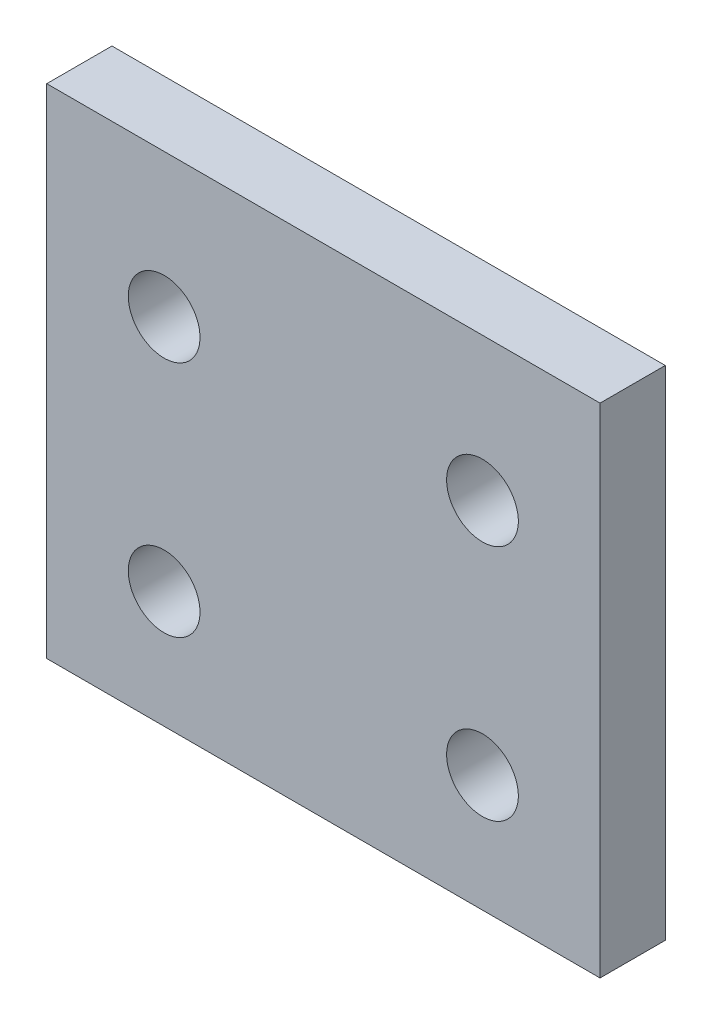
ISO-10303-21;
HEADER;
FILE_DESCRIPTION(('STEP AP214'),'2;1');
FILE_NAME('part.step','',(''),(''),'','','');
FILE_SCHEMA(('AUTOMOTIVE_DESIGN { 1 0 10303 214 1 1 1 1 }'));
ENDSEC;
DATA;
#1=APPLICATION_CONTEXT('core data for automotive mechanical design processes');
#2=APPLICATION_PROTOCOL_DEFINITION('international standard','automotive_design',2000,#1);
#3=PRODUCT_CONTEXT('',#1,'mechanical');
#4=PRODUCT('Part','Part','',(#3));
#5=PRODUCT_RELATED_PRODUCT_CATEGORY('part','',(#4));
#6=PRODUCT_DEFINITION_FORMATION('','',#4);
#7=PRODUCT_DEFINITION_CONTEXT('part definition',#1,'design');
#8=PRODUCT_DEFINITION('design','',#6,#7);
#9=PRODUCT_DEFINITION_SHAPE('','',#8);
#10=(LENGTH_UNIT() NAMED_UNIT(*) SI_UNIT(.MILLI.,.METRE.));
#11=(NAMED_UNIT(*) PLANE_ANGLE_UNIT() SI_UNIT($,.RADIAN.));
#12=(NAMED_UNIT(*) SI_UNIT($,.STERADIAN.) SOLID_ANGLE_UNIT());
#13=UNCERTAINTY_MEASURE_WITH_UNIT(LENGTH_MEASURE(1.E-05),#10,'distance_accuracy_value','');
#14=(GEOMETRIC_REPRESENTATION_CONTEXT(3) GLOBAL_UNCERTAINTY_ASSIGNED_CONTEXT((#13)) GLOBAL_UNIT_ASSIGNED_CONTEXT((#10,
#11,#12)) REPRESENTATION_CONTEXT('',''));
#15=CARTESIAN_POINT('',(0.,0.,0.));
#16=DIRECTION('',(0.,0.,1.));
#17=DIRECTION('',(1.,0.,0.));
#18=AXIS2_PLACEMENT_3D('',#15,#16,#17);
#19=CARTESIAN_POINT('',(0.,0.,2.5));
#20=DIRECTION('',(1.,0.,0.));
#21=DIRECTION('',(0.,0.,-1.));
#22=AXIS2_PLACEMENT_3D('',#19,#20,#21);
#23=PLANE('',#22);
#24=DIRECTION('',(0.,-1.,0.));
#25=VECTOR('',#24,1.);
#26=CARTESIAN_POINT('',(0.,0.,0.));
#27=LINE('',#26,#25);
#28=CARTESIAN_POINT('',(0.,19.08604853,0.));
#29=VERTEX_POINT('',#28);
#30=CARTESIAN_POINT('',(0.,0.,0.));
#31=VERTEX_POINT('',#30);
#32=EDGE_CURVE('E111',#29,#31,#27,.T.);
#33=ORIENTED_EDGE('',*,*,#32,.T.);
#34=DIRECTION('',(0.,0.,-1.));
#35=VECTOR('',#34,1.);
#36=CARTESIAN_POINT('',(0.,0.,2.5));
#37=LINE('',#36,#35);
#38=CARTESIAN_POINT('',(0.,0.,2.5));
#39=VERTEX_POINT('',#38);
#40=EDGE_CURVE('E11',#39,#31,#37,.T.);
#41=ORIENTED_EDGE('',*,*,#40,.F.);
#42=DIRECTION('',(0.,-1.,0.));
#43=VECTOR('',#42,1.);
#44=CARTESIAN_POINT('',(0.,0.,2.5));
#45=LINE('',#44,#43);
#46=CARTESIAN_POINT('',(0.,19.08604853,2.5));
#47=VERTEX_POINT('',#46);
#48=EDGE_CURVE('E94',#47,#39,#45,.T.);
#49=ORIENTED_EDGE('',*,*,#48,.F.);
#50=DIRECTION('',(0.,0.,-1.));
#51=VECTOR('',#50,1.);
#52=CARTESIAN_POINT('',(0.,19.08604853,2.5));
#53=LINE('',#52,#51);
#54=EDGE_CURVE('E107',#47,#29,#53,.T.);
#55=ORIENTED_EDGE('',*,*,#54,.T.);
#56=EDGE_LOOP('',(#33,#41,#49,#55));
#57=FACE_BOUND('',#56,.T.);
#58=ADVANCED_FACE('F42',(#57),#23,.F.);
#59=CARTESIAN_POINT('',(0.,0.,2.5));
#60=DIRECTION('',(0.,1.,0.));
#61=DIRECTION('',(0.,0.,1.));
#62=AXIS2_PLACEMENT_3D('',#59,#60,#61);
#63=PLANE('',#62);
#64=DIRECTION('',(1.,0.,0.));
#65=VECTOR('',#64,1.);
#66=CARTESIAN_POINT('',(0.,0.,0.));
#67=LINE('',#66,#65);
#68=CARTESIAN_POINT('',(21.21128765,0.,0.));
#69=VERTEX_POINT('',#68);
#70=EDGE_CURVE('E99',#31,#69,#67,.T.);
#71=ORIENTED_EDGE('',*,*,#70,.T.);
#72=DIRECTION('',(0.,0.,-1.));
#73=VECTOR('',#72,1.);
#74=CARTESIAN_POINT('',(21.21128765,0.,2.5));
#75=LINE('',#74,#73);
#76=CARTESIAN_POINT('',(21.21128765,0.,2.5));
#77=VERTEX_POINT('',#76);
#78=EDGE_CURVE('E51',#77,#69,#75,.T.);
#79=ORIENTED_EDGE('',*,*,#78,.F.);
#80=DIRECTION('',(1.,0.,0.));
#81=VECTOR('',#80,1.);
#82=CARTESIAN_POINT('',(0.,0.,2.5));
#83=LINE('',#82,#81);
#84=EDGE_CURVE('E89',#39,#77,#83,.T.);
#85=ORIENTED_EDGE('',*,*,#84,.F.);
#86=ORIENTED_EDGE('',*,*,#40,.T.);
#87=EDGE_LOOP('',(#71,#79,#85,#86));
#88=FACE_BOUND('',#87,.T.);
#89=ADVANCED_FACE('F98',(#88),#63,.F.);
#90=CARTESIAN_POINT('',(21.21128765,0.,2.5));
#91=DIRECTION('',(-1.,0.,0.));
#92=DIRECTION('',(0.,0.,1.));
#93=AXIS2_PLACEMENT_3D('',#90,#91,#92);
#94=PLANE('',#93);
#95=DIRECTION('',(0.,1.,0.));
#96=VECTOR('',#95,1.);
#97=CARTESIAN_POINT('',(21.21128765,0.,0.));
#98=LINE('',#97,#96);
#99=CARTESIAN_POINT('',(21.21128765,19.08604853,0.));
#100=VERTEX_POINT('',#99);
#101=EDGE_CURVE('E76',#69,#100,#98,.T.);
#102=ORIENTED_EDGE('',*,*,#101,.T.);
#103=DIRECTION('',(0.,0.,-1.));
#104=VECTOR('',#103,1.);
#105=CARTESIAN_POINT('',(21.21128765,19.08604853,2.5));
#106=LINE('',#105,#104);
#107=CARTESIAN_POINT('',(21.21128765,19.08604853,2.5));
#108=VERTEX_POINT('',#107);
#109=EDGE_CURVE('E101',#108,#100,#106,.T.);
#110=ORIENTED_EDGE('',*,*,#109,.F.);
#111=DIRECTION('',(0.,1.,0.));
#112=VECTOR('',#111,1.);
#113=CARTESIAN_POINT('',(21.21128765,0.,2.5));
#114=LINE('',#113,#112);
#115=EDGE_CURVE('E92',#77,#108,#114,.T.);
#116=ORIENTED_EDGE('',*,*,#115,.F.);
#117=ORIENTED_EDGE('',*,*,#78,.T.);
#118=EDGE_LOOP('',(#102,#110,#116,#117));
#119=FACE_BOUND('',#118,.T.);
#120=ADVANCED_FACE('F102',(#119),#94,.F.);
#121=CARTESIAN_POINT('',(0.,19.08604853,2.5));
#122=DIRECTION('',(0.,-1.,0.));
#123=DIRECTION('',(0.,0.,-1.));
#124=AXIS2_PLACEMENT_3D('',#121,#122,#123);
#125=PLANE('',#124);
#126=DIRECTION('',(-1.,0.,0.));
#127=VECTOR('',#126,1.);
#128=CARTESIAN_POINT('',(0.,19.08604853,0.));
#129=LINE('',#128,#127);
#130=EDGE_CURVE('E82',#100,#29,#129,.T.);
#131=ORIENTED_EDGE('',*,*,#130,.T.);
#132=ORIENTED_EDGE('',*,*,#54,.F.);
#133=DIRECTION('',(-1.,0.,0.));
#134=VECTOR('',#133,1.);
#135=CARTESIAN_POINT('',(0.,19.08604853,2.5));
#136=LINE('',#135,#134);
#137=EDGE_CURVE('E59',#108,#47,#136,.T.);
#138=ORIENTED_EDGE('',*,*,#137,.F.);
#139=ORIENTED_EDGE('',*,*,#109,.T.);
#140=EDGE_LOOP('',(#131,#132,#138,#139));
#141=FACE_BOUND('',#140,.T.);
#142=ADVANCED_FACE('F126',(#141),#125,.F.);
#143=CARTESIAN_POINT('',(0.,0.,2.5));
#144=DIRECTION('',(0.,0.,-1.));
#145=DIRECTION('',(-1.,0.,0.));
#146=AXIS2_PLACEMENT_3D('',#143,#144,#145);
#147=PLANE('',#146);
#148=CARTESIAN_POINT('',(4.50061561,13.5977062,2.5));
#149=DIRECTION('',(0.,0.,-1.));
#150=DIRECTION('',(-1.,0.,0.));
#151=AXIS2_PLACEMENT_3D('',#148,#149,#150);
#152=CIRCLE('',#151,1.375);
#153=CARTESIAN_POINT('',(3.12561561,13.5977062,2.5));
#154=VERTEX_POINT('',#153);
#155=EDGE_CURVE('E138',#154,#154,#152,.T.);
#156=ORIENTED_EDGE('',*,*,#155,.T.);
#157=EDGE_LOOP('',(#156));
#158=FACE_BOUND('',#157,.T.);
#159=CARTESIAN_POINT('',(16.70317329,4.48009656,2.5));
#160=DIRECTION('',(0.,0.,-1.));
#161=DIRECTION('',(-1.,0.,0.));
#162=AXIS2_PLACEMENT_3D('',#159,#160,#161);
#163=CIRCLE('',#162,1.375);
#164=CARTESIAN_POINT('',(15.32817329,4.48009656,2.5));
#165=VERTEX_POINT('',#164);
#166=EDGE_CURVE('E146',#165,#165,#163,.T.);
#167=ORIENTED_EDGE('',*,*,#166,.T.);
#168=EDGE_LOOP('',(#167));
#169=FACE_BOUND('',#168,.T.);
#170=CARTESIAN_POINT('',(4.50061561,4.48009656,2.5));
#171=DIRECTION('',(0.,0.,-1.));
#172=DIRECTION('',(-1.,0.,0.));
#173=AXIS2_PLACEMENT_3D('',#170,#171,#172);
#174=CIRCLE('',#173,1.375);
#175=CARTESIAN_POINT('',(3.12561561,4.48009656,2.5));
#176=VERTEX_POINT('',#175);
#177=EDGE_CURVE('E147',#176,#176,#174,.T.);
#178=ORIENTED_EDGE('',*,*,#177,.T.);
#179=EDGE_LOOP('',(#178));
#180=FACE_BOUND('',#179,.T.);
#181=CARTESIAN_POINT('',(16.70317329,13.5977062,2.5));
#182=DIRECTION('',(0.,0.,-1.));
#183=DIRECTION('',(-1.,0.,0.));
#184=AXIS2_PLACEMENT_3D('',#181,#182,#183);
#185=CIRCLE('',#184,1.375);
#186=CARTESIAN_POINT('',(15.32817329,13.5977062,2.5));
#187=VERTEX_POINT('',#186);
#188=EDGE_CURVE('E115',#187,#187,#185,.T.);
#189=ORIENTED_EDGE('',*,*,#188,.T.);
#190=EDGE_LOOP('',(#189));
#191=FACE_BOUND('',#190,.T.);
#192=ORIENTED_EDGE('',*,*,#48,.T.);
#193=ORIENTED_EDGE('',*,*,#84,.T.);
#194=ORIENTED_EDGE('',*,*,#115,.T.);
#195=ORIENTED_EDGE('',*,*,#137,.T.);
#196=EDGE_LOOP('',(#192,#193,#194,#195));
#197=FACE_BOUND('',#196,.T.);
#198=ADVANCED_FACE('F90',(#158,#169,#180,#191,#197),#147,.F.);
#199=CARTESIAN_POINT('',(0.,0.,0.));
#200=DIRECTION('',(0.,0.,-1.));
#201=DIRECTION('',(-1.,0.,0.));
#202=AXIS2_PLACEMENT_3D('',#199,#200,#201);
#203=PLANE('',#202);
#204=CARTESIAN_POINT('',(4.50061561,13.5977062,0.));
#205=DIRECTION('',(0.,0.,-1.));
#206=DIRECTION('',(-1.,0.,0.));
#207=AXIS2_PLACEMENT_3D('',#204,#205,#206);
#208=CIRCLE('',#207,1.375);
#209=CARTESIAN_POINT('',(3.12561561,13.5977062,0.));
#210=VERTEX_POINT('',#209);
#211=EDGE_CURVE('E151',#210,#210,#208,.T.);
#212=ORIENTED_EDGE('',*,*,#211,.F.);
#213=EDGE_LOOP('',(#212));
#214=FACE_BOUND('',#213,.T.);
#215=CARTESIAN_POINT('',(16.70317329,4.48009656,0.));
#216=DIRECTION('',(0.,0.,-1.));
#217=DIRECTION('',(-1.,0.,0.));
#218=AXIS2_PLACEMENT_3D('',#215,#216,#217);
#219=CIRCLE('',#218,1.375);
#220=CARTESIAN_POINT('',(15.32817329,4.48009656,0.));
#221=VERTEX_POINT('',#220);
#222=EDGE_CURVE('E142',#221,#221,#219,.T.);
#223=ORIENTED_EDGE('',*,*,#222,.F.);
#224=EDGE_LOOP('',(#223));
#225=FACE_BOUND('',#224,.T.);
#226=CARTESIAN_POINT('',(4.50061561,4.48009656,0.));
#227=DIRECTION('',(0.,0.,-1.));
#228=DIRECTION('',(-1.,0.,0.));
#229=AXIS2_PLACEMENT_3D('',#226,#227,#228);
#230=CIRCLE('',#229,1.375);
#231=CARTESIAN_POINT('',(3.12561561,4.48009656,0.));
#232=VERTEX_POINT('',#231);
#233=EDGE_CURVE('E158',#232,#232,#230,.T.);
#234=ORIENTED_EDGE('',*,*,#233,.F.);
#235=EDGE_LOOP('',(#234));
#236=FACE_BOUND('',#235,.T.);
#237=CARTESIAN_POINT('',(16.70317329,13.5977062,0.));
#238=DIRECTION('',(0.,0.,-1.));
#239=DIRECTION('',(-1.,0.,0.));
#240=AXIS2_PLACEMENT_3D('',#237,#238,#239);
#241=CIRCLE('',#240,1.375);
#242=CARTESIAN_POINT('',(15.32817329,13.5977062,0.));
#243=VERTEX_POINT('',#242);
#244=EDGE_CURVE('E134',#243,#243,#241,.T.);
#245=ORIENTED_EDGE('',*,*,#244,.F.);
#246=EDGE_LOOP('',(#245));
#247=FACE_BOUND('',#246,.T.);
#248=ORIENTED_EDGE('',*,*,#32,.F.);
#249=ORIENTED_EDGE('',*,*,#130,.F.);
#250=ORIENTED_EDGE('',*,*,#101,.F.);
#251=ORIENTED_EDGE('',*,*,#70,.F.);
#252=EDGE_LOOP('',(#248,#249,#250,#251));
#253=FACE_BOUND('',#252,.T.);
#254=ADVANCED_FACE('F129',(#214,#225,#236,#247,#253),#203,.T.);
#255=CARTESIAN_POINT('',(16.70317329,13.5977062,2.5));
#256=DIRECTION('',(0.,0.,-1.));
#257=DIRECTION('',(-1.,0.,0.));
#258=AXIS2_PLACEMENT_3D('',#255,#256,#257);
#259=CYLINDRICAL_SURFACE('',#258,1.375);
#260=ORIENTED_EDGE('',*,*,#188,.F.);
#261=EDGE_LOOP('',(#260));
#262=FACE_BOUND('',#261,.T.);
#263=ORIENTED_EDGE('',*,*,#244,.T.);
#264=EDGE_LOOP('',(#263));
#265=FACE_BOUND('',#264,.T.);
#266=ADVANCED_FACE('F173',(#262,#265),#259,.F.);
#267=CARTESIAN_POINT('',(4.50061561,4.48009656,2.5));
#268=DIRECTION('',(0.,0.,-1.));
#269=DIRECTION('',(-1.,0.,0.));
#270=AXIS2_PLACEMENT_3D('',#267,#268,#269);
#271=CYLINDRICAL_SURFACE('',#270,1.375);
#272=ORIENTED_EDGE('',*,*,#177,.F.);
#273=EDGE_LOOP('',(#272));
#274=FACE_BOUND('',#273,.T.);
#275=ORIENTED_EDGE('',*,*,#233,.T.);
#276=EDGE_LOOP('',(#275));
#277=FACE_BOUND('',#276,.T.);
#278=ADVANCED_FACE('F169',(#274,#277),#271,.F.);
#279=CARTESIAN_POINT('',(16.70317329,4.48009656,2.5));
#280=DIRECTION('',(0.,0.,-1.));
#281=DIRECTION('',(-1.,0.,0.));
#282=AXIS2_PLACEMENT_3D('',#279,#280,#281);
#283=CYLINDRICAL_SURFACE('',#282,1.375);
#284=ORIENTED_EDGE('',*,*,#166,.F.);
#285=EDGE_LOOP('',(#284));
#286=FACE_BOUND('',#285,.T.);
#287=ORIENTED_EDGE('',*,*,#222,.T.);
#288=EDGE_LOOP('',(#287));
#289=FACE_BOUND('',#288,.T.);
#290=ADVANCED_FACE('F172',(#286,#289),#283,.F.);
#291=CARTESIAN_POINT('',(4.50061561,13.5977062,2.5));
#292=DIRECTION('',(0.,0.,-1.));
#293=DIRECTION('',(-1.,0.,0.));
#294=AXIS2_PLACEMENT_3D('',#291,#292,#293);
#295=CYLINDRICAL_SURFACE('',#294,1.375);
#296=ORIENTED_EDGE('',*,*,#155,.F.);
#297=EDGE_LOOP('',(#296));
#298=FACE_BOUND('',#297,.T.);
#299=ORIENTED_EDGE('',*,*,#211,.T.);
#300=EDGE_LOOP('',(#299));
#301=FACE_BOUND('',#300,.T.);
#302=ADVANCED_FACE('F211',(#298,#301),#295,.F.);
#303=CLOSED_SHELL('',(#58,#89,#120,#142,#198,#254,#266,#278,#290,#302));
#304=MANIFOLD_SOLID_BREP('B2',#303);
#305=ADVANCED_BREP_SHAPE_REPRESENTATION('',(#18,#304),#14);
#306=SHAPE_DEFINITION_REPRESENTATION(#9,#305);
ENDSEC;
END-ISO-10303-21;
